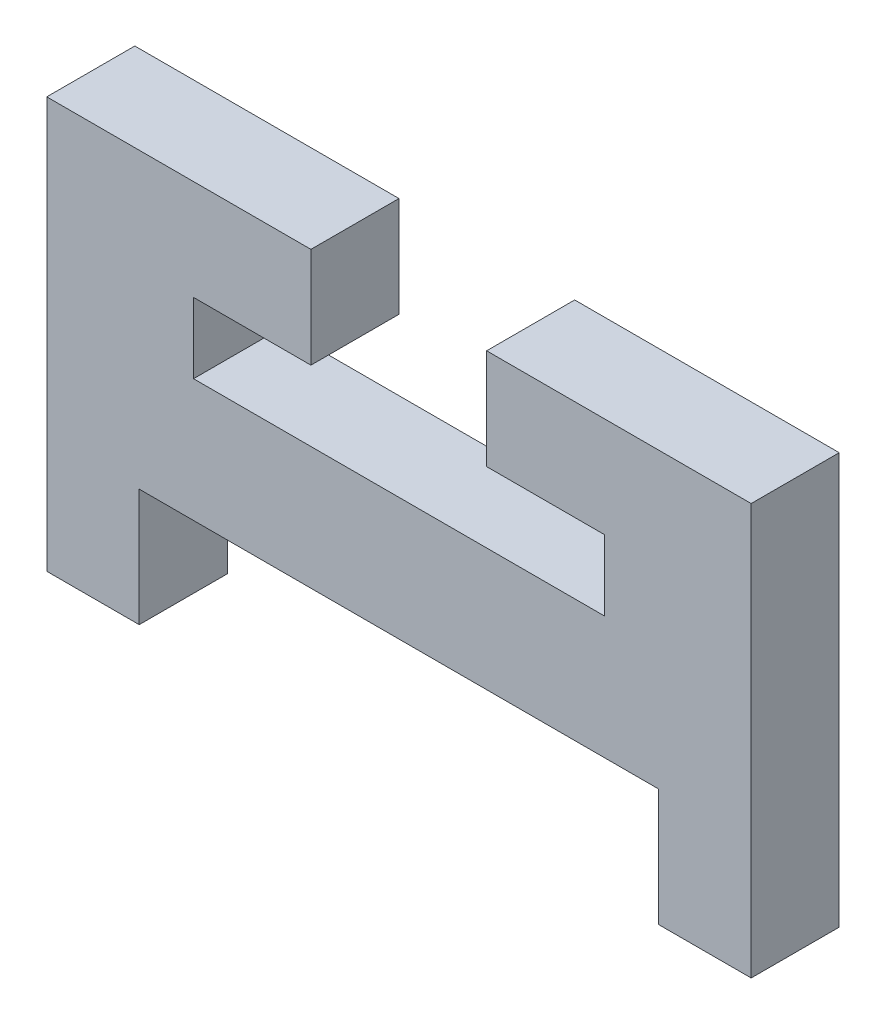
ISO-10303-21;
HEADER;
FILE_DESCRIPTION(('STEP AP214'),'2;1');
FILE_NAME('part.step','',(''),(''),'','','');
FILE_SCHEMA(('AUTOMOTIVE_DESIGN { 1 0 10303 214 1 1 1 1 }'));
ENDSEC;
DATA;
#1=APPLICATION_CONTEXT('core data for automotive mechanical design processes');
#2=APPLICATION_PROTOCOL_DEFINITION('international standard','automotive_design',2000,#1);
#3=PRODUCT_CONTEXT('',#1,'mechanical');
#4=PRODUCT('Part','Part','',(#3));
#5=PRODUCT_RELATED_PRODUCT_CATEGORY('part','',(#4));
#6=PRODUCT_DEFINITION_FORMATION('','',#4);
#7=PRODUCT_DEFINITION_CONTEXT('part definition',#1,'design');
#8=PRODUCT_DEFINITION('design','',#6,#7);
#9=PRODUCT_DEFINITION_SHAPE('','',#8);
#10=(LENGTH_UNIT() NAMED_UNIT(*) SI_UNIT(.MILLI.,.METRE.));
#11=(NAMED_UNIT(*) PLANE_ANGLE_UNIT() SI_UNIT($,.RADIAN.));
#12=(NAMED_UNIT(*) SI_UNIT($,.STERADIAN.) SOLID_ANGLE_UNIT());
#13=UNCERTAINTY_MEASURE_WITH_UNIT(LENGTH_MEASURE(1.E-05),#10,'distance_accuracy_value','');
#14=(GEOMETRIC_REPRESENTATION_CONTEXT(3) GLOBAL_UNCERTAINTY_ASSIGNED_CONTEXT((#13)) GLOBAL_UNIT_ASSIGNED_CONTEXT((#10,
#11,#12)) REPRESENTATION_CONTEXT('',''));
#15=CARTESIAN_POINT('',(0.,0.,0.));
#16=DIRECTION('',(0.,0.,1.));
#17=DIRECTION('',(1.,0.,0.));
#18=AXIS2_PLACEMENT_3D('',#15,#16,#17);
#19=CARTESIAN_POINT('',(29.5,19.6826832944775,3.));
#20=DIRECTION('',(0.,-1.,0.));
#21=DIRECTION('',(0.,0.,-1.));
#22=AXIS2_PLACEMENT_3D('',#19,#20,#21);
#23=PLANE('',#22);
#24=DIRECTION('',(-1.,0.,0.));
#25=VECTOR('',#24,1.);
#26=CARTESIAN_POINT('',(29.5,19.6826832944775,0.));
#27=LINE('',#26,#25);
#28=CARTESIAN_POINT('',(36.,19.6826832944775,0.));
#29=VERTEX_POINT('',#28);
#30=CARTESIAN_POINT('',(22.,19.6826832944775,0.));
#31=VERTEX_POINT('',#30);
#32=EDGE_CURVE('E109',#29,#31,#27,.T.);
#33=ORIENTED_EDGE('',*,*,#32,.T.);
#34=DIRECTION('',(0.,0.,-1.));
#35=VECTOR('',#34,1.);
#36=CARTESIAN_POINT('',(22.,19.6826832944775,3.));
#37=LINE('',#36,#35);
#38=CARTESIAN_POINT('',(22.,19.6826832944775,3.));
#39=VERTEX_POINT('',#38);
#40=EDGE_CURVE('E11',#39,#31,#37,.T.);
#41=ORIENTED_EDGE('',*,*,#40,.F.);
#42=DIRECTION('',(-1.,0.,0.));
#43=VECTOR('',#42,1.);
#44=CARTESIAN_POINT('',(36.,19.6826832944775,3.));
#45=LINE('',#44,#43);
#46=CARTESIAN_POINT('',(36.,19.6826832944775,3.));
#47=VERTEX_POINT('',#46);
#48=EDGE_CURVE('E115',#47,#39,#45,.T.);
#49=ORIENTED_EDGE('',*,*,#48,.F.);
#50=DIRECTION('',(0.,0.,-1.));
#51=VECTOR('',#50,1.);
#52=CARTESIAN_POINT('',(36.,19.6826832944775,3.));
#53=LINE('',#52,#51);
#54=EDGE_CURVE('E173',#47,#29,#53,.T.);
#55=ORIENTED_EDGE('',*,*,#54,.T.);
#56=EDGE_LOOP('',(#33,#41,#49,#55));
#57=FACE_BOUND('',#56,.T.);
#58=ADVANCED_FACE('F33',(#57),#23,.F.);
#59=CARTESIAN_POINT('',(22.,19.6826832944775,3.));
#60=DIRECTION('',(-1.,0.,0.));
#61=DIRECTION('',(0.,0.,1.));
#62=AXIS2_PLACEMENT_3D('',#59,#60,#61);
#63=PLANE('',#62);
#64=DIRECTION('',(0.,1.,0.));
#65=VECTOR('',#64,1.);
#66=CARTESIAN_POINT('',(22.,19.6826832944775,0.));
#67=LINE('',#66,#65);
#68=CARTESIAN_POINT('',(22.,22.0826832944775,0.));
#69=VERTEX_POINT('',#68);
#70=EDGE_CURVE('E178',#31,#69,#67,.T.);
#71=ORIENTED_EDGE('',*,*,#70,.T.);
#72=DIRECTION('',(0.,0.,-1.));
#73=VECTOR('',#72,1.);
#74=CARTESIAN_POINT('',(22.,22.0826832944775,3.));
#75=LINE('',#74,#73);
#76=CARTESIAN_POINT('',(22.,22.0826832944775,3.));
#77=VERTEX_POINT('',#76);
#78=EDGE_CURVE('E41',#77,#69,#75,.T.);
#79=ORIENTED_EDGE('',*,*,#78,.F.);
#80=DIRECTION('',(0.,1.,0.));
#81=VECTOR('',#80,1.);
#82=CARTESIAN_POINT('',(22.,19.6826832944775,3.));
#83=LINE('',#82,#81);
#84=EDGE_CURVE('E294',#39,#77,#83,.T.);
#85=ORIENTED_EDGE('',*,*,#84,.F.);
#86=ORIENTED_EDGE('',*,*,#40,.T.);
#87=EDGE_LOOP('',(#71,#79,#85,#86));
#88=FACE_BOUND('',#87,.T.);
#89=ADVANCED_FACE('F297',(#88),#63,.F.);
#90=CARTESIAN_POINT('',(22.,22.0826832944775,3.));
#91=DIRECTION('',(0.,1.,0.));
#92=DIRECTION('',(0.,0.,1.));
#93=AXIS2_PLACEMENT_3D('',#90,#91,#92);
#94=PLANE('',#93);
#95=DIRECTION('',(1.,0.,0.));
#96=VECTOR('',#95,1.);
#97=CARTESIAN_POINT('',(22.,22.0826832944775,0.));
#98=LINE('',#97,#96);
#99=CARTESIAN_POINT('',(26.,22.0826832944775,0.));
#100=VERTEX_POINT('',#99);
#101=EDGE_CURVE('E180',#69,#100,#98,.T.);
#102=ORIENTED_EDGE('',*,*,#101,.T.);
#103=DIRECTION('',(0.,0.,-1.));
#104=VECTOR('',#103,1.);
#105=CARTESIAN_POINT('',(26.,22.0826832944775,3.));
#106=LINE('',#105,#104);
#107=CARTESIAN_POINT('',(26.,22.0826832944775,3.));
#108=VERTEX_POINT('',#107);
#109=EDGE_CURVE('E237',#108,#100,#106,.T.);
#110=ORIENTED_EDGE('',*,*,#109,.F.);
#111=DIRECTION('',(1.,0.,0.));
#112=VECTOR('',#111,1.);
#113=CARTESIAN_POINT('',(22.,22.0826832944775,3.));
#114=LINE('',#113,#112);
#115=EDGE_CURVE('E246',#77,#108,#114,.T.);
#116=ORIENTED_EDGE('',*,*,#115,.F.);
#117=ORIENTED_EDGE('',*,*,#78,.T.);
#118=EDGE_LOOP('',(#102,#110,#116,#117));
#119=FACE_BOUND('',#118,.T.);
#120=ADVANCED_FACE('F244',(#119),#94,.F.);
#121=CARTESIAN_POINT('',(26.,22.0826832944775,3.));
#122=DIRECTION('',(-1.,0.,0.));
#123=DIRECTION('',(0.,0.,1.));
#124=AXIS2_PLACEMENT_3D('',#121,#122,#123);
#125=PLANE('',#124);
#126=DIRECTION('',(0.,1.,0.));
#127=VECTOR('',#126,1.);
#128=CARTESIAN_POINT('',(26.,22.0826832944775,0.));
#129=LINE('',#128,#127);
#130=CARTESIAN_POINT('',(26.,25.5,0.));
#131=VERTEX_POINT('',#130);
#132=EDGE_CURVE('E182',#100,#131,#129,.T.);
#133=ORIENTED_EDGE('',*,*,#132,.T.);
#134=DIRECTION('',(0.,0.,-1.));
#135=VECTOR('',#134,1.);
#136=CARTESIAN_POINT('',(26.,25.5,3.));
#137=LINE('',#136,#135);
#138=CARTESIAN_POINT('',(26.,25.5,3.));
#139=VERTEX_POINT('',#138);
#140=EDGE_CURVE('E234',#139,#131,#137,.T.);
#141=ORIENTED_EDGE('',*,*,#140,.F.);
#142=DIRECTION('',(0.,1.,0.));
#143=VECTOR('',#142,1.);
#144=CARTESIAN_POINT('',(26.,22.0826832944775,3.));
#145=LINE('',#144,#143);
#146=EDGE_CURVE('E264',#108,#139,#145,.T.);
#147=ORIENTED_EDGE('',*,*,#146,.F.);
#148=ORIENTED_EDGE('',*,*,#109,.T.);
#149=EDGE_LOOP('',(#133,#141,#147,#148));
#150=FACE_BOUND('',#149,.T.);
#151=ADVANCED_FACE('F255',(#150),#125,.F.);
#152=CARTESIAN_POINT('',(26.,25.5,3.));
#153=DIRECTION('',(0.,-1.,0.));
#154=DIRECTION('',(0.,0.,-1.));
#155=AXIS2_PLACEMENT_3D('',#152,#153,#154);
#156=PLANE('',#155);
#157=DIRECTION('',(-1.,0.,0.));
#158=VECTOR('',#157,1.);
#159=CARTESIAN_POINT('',(26.,25.5,0.));
#160=LINE('',#159,#158);
#161=CARTESIAN_POINT('',(17.,25.5,0.));
#162=VERTEX_POINT('',#161);
#163=EDGE_CURVE('E184',#131,#162,#160,.T.);
#164=ORIENTED_EDGE('',*,*,#163,.T.);
#165=DIRECTION('',(0.,0.,-1.));
#166=VECTOR('',#165,1.);
#167=CARTESIAN_POINT('',(17.,25.5,3.));
#168=LINE('',#167,#166);
#169=CARTESIAN_POINT('',(17.,25.5,3.));
#170=VERTEX_POINT('',#169);
#171=EDGE_CURVE('E231',#170,#162,#168,.T.);
#172=ORIENTED_EDGE('',*,*,#171,.F.);
#173=DIRECTION('',(-1.,0.,0.));
#174=VECTOR('',#173,1.);
#175=CARTESIAN_POINT('',(26.,25.5,3.));
#176=LINE('',#175,#174);
#177=EDGE_CURVE('E261',#139,#170,#176,.T.);
#178=ORIENTED_EDGE('',*,*,#177,.F.);
#179=ORIENTED_EDGE('',*,*,#140,.T.);
#180=EDGE_LOOP('',(#164,#172,#178,#179));
#181=FACE_BOUND('',#180,.T.);
#182=ADVANCED_FACE('F259',(#181),#156,.F.);
#183=CARTESIAN_POINT('',(17.,25.5,3.));
#184=DIRECTION('',(1.,0.,0.));
#185=DIRECTION('',(0.,0.,-1.));
#186=AXIS2_PLACEMENT_3D('',#183,#184,#185);
#187=PLANE('',#186);
#188=DIRECTION('',(0.,-1.,0.));
#189=VECTOR('',#188,1.);
#190=CARTESIAN_POINT('',(17.,25.5,0.));
#191=LINE('',#190,#189);
#192=CARTESIAN_POINT('',(17.,11.5,0.));
#193=VERTEX_POINT('',#192);
#194=EDGE_CURVE('E186',#162,#193,#191,.T.);
#195=ORIENTED_EDGE('',*,*,#194,.T.);
#196=DIRECTION('',(0.,0.,-1.));
#197=VECTOR('',#196,1.);
#198=CARTESIAN_POINT('',(17.,11.5,3.));
#199=LINE('',#198,#197);
#200=CARTESIAN_POINT('',(17.,11.5,3.));
#201=VERTEX_POINT('',#200);
#202=EDGE_CURVE('E228',#201,#193,#199,.T.);
#203=ORIENTED_EDGE('',*,*,#202,.F.);
#204=DIRECTION('',(0.,-1.,0.));
#205=VECTOR('',#204,1.);
#206=CARTESIAN_POINT('',(17.,25.5,3.));
#207=LINE('',#206,#205);
#208=EDGE_CURVE('E263',#170,#201,#207,.T.);
#209=ORIENTED_EDGE('',*,*,#208,.F.);
#210=ORIENTED_EDGE('',*,*,#171,.T.);
#211=EDGE_LOOP('',(#195,#203,#209,#210));
#212=FACE_BOUND('',#211,.T.);
#213=ADVANCED_FACE('F309',(#212),#187,.F.);
#214=CARTESIAN_POINT('',(17.,11.5,3.));
#215=DIRECTION('',(0.,1.,0.));
#216=DIRECTION('',(0.,0.,1.));
#217=AXIS2_PLACEMENT_3D('',#214,#215,#216);
#218=PLANE('',#217);
#219=DIRECTION('',(1.,0.,0.));
#220=VECTOR('',#219,1.);
#221=CARTESIAN_POINT('',(17.,11.5,0.));
#222=LINE('',#221,#220);
#223=CARTESIAN_POINT('',(20.15,11.5,0.));
#224=VERTEX_POINT('',#223);
#225=EDGE_CURVE('E188',#193,#224,#222,.T.);
#226=ORIENTED_EDGE('',*,*,#225,.T.);
#227=DIRECTION('',(0.,0.,-1.));
#228=VECTOR('',#227,1.);
#229=CARTESIAN_POINT('',(20.15,11.5,3.));
#230=LINE('',#229,#228);
#231=CARTESIAN_POINT('',(20.15,11.5,3.));
#232=VERTEX_POINT('',#231);
#233=EDGE_CURVE('E225',#232,#224,#230,.T.);
#234=ORIENTED_EDGE('',*,*,#233,.F.);
#235=DIRECTION('',(1.,0.,0.));
#236=VECTOR('',#235,1.);
#237=CARTESIAN_POINT('',(17.,11.5,3.));
#238=LINE('',#237,#236);
#239=EDGE_CURVE('E266',#201,#232,#238,.T.);
#240=ORIENTED_EDGE('',*,*,#239,.F.);
#241=ORIENTED_EDGE('',*,*,#202,.T.);
#242=EDGE_LOOP('',(#226,#234,#240,#241));
#243=FACE_BOUND('',#242,.T.);
#244=ADVANCED_FACE('F312',(#243),#218,.F.);
#245=CARTESIAN_POINT('',(20.15,11.5,3.));
#246=DIRECTION('',(-1.,0.,0.));
#247=DIRECTION('',(0.,0.,1.));
#248=AXIS2_PLACEMENT_3D('',#245,#246,#247);
#249=PLANE('',#248);
#250=DIRECTION('',(0.,1.,0.));
#251=VECTOR('',#250,1.);
#252=CARTESIAN_POINT('',(20.15,11.5,0.));
#253=LINE('',#252,#251);
#254=CARTESIAN_POINT('',(20.15,15.5,0.));
#255=VERTEX_POINT('',#254);
#256=EDGE_CURVE('E190',#224,#255,#253,.T.);
#257=ORIENTED_EDGE('',*,*,#256,.T.);
#258=DIRECTION('',(0.,0.,-1.));
#259=VECTOR('',#258,1.);
#260=CARTESIAN_POINT('',(20.15,15.5,3.));
#261=LINE('',#260,#259);
#262=CARTESIAN_POINT('',(20.15,15.5,3.));
#263=VERTEX_POINT('',#262);
#264=EDGE_CURVE('E222',#263,#255,#261,.T.);
#265=ORIENTED_EDGE('',*,*,#264,.F.);
#266=DIRECTION('',(0.,1.,0.));
#267=VECTOR('',#266,1.);
#268=CARTESIAN_POINT('',(20.15,11.5,3.));
#269=LINE('',#268,#267);
#270=EDGE_CURVE('E272',#232,#263,#269,.T.);
#271=ORIENTED_EDGE('',*,*,#270,.F.);
#272=ORIENTED_EDGE('',*,*,#233,.T.);
#273=EDGE_LOOP('',(#257,#265,#271,#272));
#274=FACE_BOUND('',#273,.T.);
#275=ADVANCED_FACE('F316',(#274),#249,.F.);
#276=CARTESIAN_POINT('',(20.15,15.5,3.));
#277=DIRECTION('',(0.,1.,0.));
#278=DIRECTION('',(0.,0.,1.));
#279=AXIS2_PLACEMENT_3D('',#276,#277,#278);
#280=PLANE('',#279);
#281=DIRECTION('',(1.,0.,0.));
#282=VECTOR('',#281,1.);
#283=CARTESIAN_POINT('',(20.15,15.5,0.));
#284=LINE('',#283,#282);
#285=CARTESIAN_POINT('',(37.85,15.5,0.));
#286=VERTEX_POINT('',#285);
#287=EDGE_CURVE('E192',#255,#286,#284,.T.);
#288=ORIENTED_EDGE('',*,*,#287,.T.);
#289=DIRECTION('',(0.,0.,-1.));
#290=VECTOR('',#289,1.);
#291=CARTESIAN_POINT('',(37.85,15.5,3.));
#292=LINE('',#291,#290);
#293=CARTESIAN_POINT('',(37.85,15.5,3.));
#294=VERTEX_POINT('',#293);
#295=EDGE_CURVE('E219',#294,#286,#292,.T.);
#296=ORIENTED_EDGE('',*,*,#295,.F.);
#297=DIRECTION('',(1.,0.,0.));
#298=VECTOR('',#297,1.);
#299=CARTESIAN_POINT('',(20.15,15.5,3.));
#300=LINE('',#299,#298);
#301=EDGE_CURVE('E274',#263,#294,#300,.T.);
#302=ORIENTED_EDGE('',*,*,#301,.F.);
#303=ORIENTED_EDGE('',*,*,#264,.T.);
#304=EDGE_LOOP('',(#288,#296,#302,#303));
#305=FACE_BOUND('',#304,.T.);
#306=ADVANCED_FACE('F320',(#305),#280,.F.);
#307=CARTESIAN_POINT('',(37.85,15.5,3.));
#308=DIRECTION('',(1.,0.,0.));
#309=DIRECTION('',(0.,0.,-1.));
#310=AXIS2_PLACEMENT_3D('',#307,#308,#309);
#311=PLANE('',#310);
#312=DIRECTION('',(0.,-1.,0.));
#313=VECTOR('',#312,1.);
#314=CARTESIAN_POINT('',(37.85,15.5,0.));
#315=LINE('',#314,#313);
#316=CARTESIAN_POINT('',(37.85,11.5,0.));
#317=VERTEX_POINT('',#316);
#318=EDGE_CURVE('E194',#286,#317,#315,.T.);
#319=ORIENTED_EDGE('',*,*,#318,.T.);
#320=DIRECTION('',(0.,0.,-1.));
#321=VECTOR('',#320,1.);
#322=CARTESIAN_POINT('',(37.85,11.5,3.));
#323=LINE('',#322,#321);
#324=CARTESIAN_POINT('',(37.85,11.5,3.));
#325=VERTEX_POINT('',#324);
#326=EDGE_CURVE('E216',#325,#317,#323,.T.);
#327=ORIENTED_EDGE('',*,*,#326,.F.);
#328=DIRECTION('',(0.,-1.,0.));
#329=VECTOR('',#328,1.);
#330=CARTESIAN_POINT('',(37.85,15.5,3.));
#331=LINE('',#330,#329);
#332=EDGE_CURVE('E276',#294,#325,#331,.T.);
#333=ORIENTED_EDGE('',*,*,#332,.F.);
#334=ORIENTED_EDGE('',*,*,#295,.T.);
#335=EDGE_LOOP('',(#319,#327,#333,#334));
#336=FACE_BOUND('',#335,.T.);
#337=ADVANCED_FACE('F324',(#336),#311,.F.);
#338=CARTESIAN_POINT('',(37.85,11.5,3.));
#339=DIRECTION('',(0.,1.,0.));
#340=DIRECTION('',(0.,0.,1.));
#341=AXIS2_PLACEMENT_3D('',#338,#339,#340);
#342=PLANE('',#341);
#343=DIRECTION('',(1.,0.,0.));
#344=VECTOR('',#343,1.);
#345=CARTESIAN_POINT('',(37.85,11.5,0.));
#346=LINE('',#345,#344);
#347=CARTESIAN_POINT('',(41.,11.5,0.));
#348=VERTEX_POINT('',#347);
#349=EDGE_CURVE('E196',#317,#348,#346,.T.);
#350=ORIENTED_EDGE('',*,*,#349,.T.);
#351=DIRECTION('',(0.,0.,-1.));
#352=VECTOR('',#351,1.);
#353=CARTESIAN_POINT('',(41.,11.5,3.));
#354=LINE('',#353,#352);
#355=CARTESIAN_POINT('',(41.,11.5,3.));
#356=VERTEX_POINT('',#355);
#357=EDGE_CURVE('E213',#356,#348,#354,.T.);
#358=ORIENTED_EDGE('',*,*,#357,.F.);
#359=DIRECTION('',(1.,0.,0.));
#360=VECTOR('',#359,1.);
#361=CARTESIAN_POINT('',(37.85,11.5,3.));
#362=LINE('',#361,#360);
#363=EDGE_CURVE('E278',#325,#356,#362,.T.);
#364=ORIENTED_EDGE('',*,*,#363,.F.);
#365=ORIENTED_EDGE('',*,*,#326,.T.);
#366=EDGE_LOOP('',(#350,#358,#364,#365));
#367=FACE_BOUND('',#366,.T.);
#368=ADVANCED_FACE('F328',(#367),#342,.F.);
#369=CARTESIAN_POINT('',(41.,11.5,3.));
#370=DIRECTION('',(-1.,0.,0.));
#371=DIRECTION('',(0.,0.,1.));
#372=AXIS2_PLACEMENT_3D('',#369,#370,#371);
#373=PLANE('',#372);
#374=DIRECTION('',(0.,1.,0.));
#375=VECTOR('',#374,1.);
#376=CARTESIAN_POINT('',(41.,11.5,0.));
#377=LINE('',#376,#375);
#378=CARTESIAN_POINT('',(41.,25.5,0.));
#379=VERTEX_POINT('',#378);
#380=EDGE_CURVE('E198',#348,#379,#377,.T.);
#381=ORIENTED_EDGE('',*,*,#380,.T.);
#382=DIRECTION('',(0.,0.,-1.));
#383=VECTOR('',#382,1.);
#384=CARTESIAN_POINT('',(41.,25.5,3.));
#385=LINE('',#384,#383);
#386=CARTESIAN_POINT('',(41.,25.5,3.));
#387=VERTEX_POINT('',#386);
#388=EDGE_CURVE('E210',#387,#379,#385,.T.);
#389=ORIENTED_EDGE('',*,*,#388,.F.);
#390=DIRECTION('',(0.,1.,0.));
#391=VECTOR('',#390,1.);
#392=CARTESIAN_POINT('',(41.,11.5,3.));
#393=LINE('',#392,#391);
#394=EDGE_CURVE('E280',#356,#387,#393,.T.);
#395=ORIENTED_EDGE('',*,*,#394,.F.);
#396=ORIENTED_EDGE('',*,*,#357,.T.);
#397=EDGE_LOOP('',(#381,#389,#395,#396));
#398=FACE_BOUND('',#397,.T.);
#399=ADVANCED_FACE('F286',(#398),#373,.F.);
#400=CARTESIAN_POINT('',(41.,25.5,3.));
#401=DIRECTION('',(0.,-1.,0.));
#402=DIRECTION('',(0.,0.,-1.));
#403=AXIS2_PLACEMENT_3D('',#400,#401,#402);
#404=PLANE('',#403);
#405=DIRECTION('',(-1.,0.,0.));
#406=VECTOR('',#405,1.);
#407=CARTESIAN_POINT('',(41.,25.5,0.));
#408=LINE('',#407,#406);
#409=CARTESIAN_POINT('',(31.9863854020223,25.5,0.));
#410=VERTEX_POINT('',#409);
#411=EDGE_CURVE('E200',#379,#410,#408,.T.);
#412=ORIENTED_EDGE('',*,*,#411,.T.);
#413=DIRECTION('',(0.,0.,-1.));
#414=VECTOR('',#413,1.);
#415=CARTESIAN_POINT('',(31.9863854020223,25.5,3.));
#416=LINE('',#415,#414);
#417=CARTESIAN_POINT('',(31.9863854020223,25.5,3.));
#418=VERTEX_POINT('',#417);
#419=EDGE_CURVE('E168',#418,#410,#416,.T.);
#420=ORIENTED_EDGE('',*,*,#419,.F.);
#421=DIRECTION('',(-1.,0.,0.));
#422=VECTOR('',#421,1.);
#423=CARTESIAN_POINT('',(41.,25.5,3.));
#424=LINE('',#423,#422);
#425=EDGE_CURVE('E159',#387,#418,#424,.T.);
#426=ORIENTED_EDGE('',*,*,#425,.F.);
#427=ORIENTED_EDGE('',*,*,#388,.T.);
#428=EDGE_LOOP('',(#412,#420,#426,#427));
#429=FACE_BOUND('',#428,.T.);
#430=ADVANCED_FACE('F290',(#429),#404,.F.);
#431=CARTESIAN_POINT('',(31.9863854020223,25.5,3.));
#432=DIRECTION('',(1.,0.,0.));
#433=DIRECTION('',(0.,0.,-1.));
#434=AXIS2_PLACEMENT_3D('',#431,#432,#433);
#435=PLANE('',#434);
#436=DIRECTION('',(0.,-1.,0.));
#437=VECTOR('',#436,1.);
#438=CARTESIAN_POINT('',(31.9863854020223,25.5,0.));
#439=LINE('',#438,#437);
#440=CARTESIAN_POINT('',(31.9863854020223,22.0826832944775,0.));
#441=VERTEX_POINT('',#440);
#442=EDGE_CURVE('E167',#410,#441,#439,.T.);
#443=ORIENTED_EDGE('',*,*,#442,.T.);
#444=DIRECTION('',(0.,0.,-1.));
#445=VECTOR('',#444,1.);
#446=CARTESIAN_POINT('',(31.9863854020223,22.0826832944775,3.));
#447=LINE('',#446,#445);
#448=CARTESIAN_POINT('',(31.9863854020223,22.0826832944775,3.));
#449=VERTEX_POINT('',#448);
#450=EDGE_CURVE('E164',#449,#441,#447,.T.);
#451=ORIENTED_EDGE('',*,*,#450,.F.);
#452=DIRECTION('',(0.,-1.,0.));
#453=VECTOR('',#452,1.);
#454=CARTESIAN_POINT('',(31.9863854020223,25.5,3.));
#455=LINE('',#454,#453);
#456=EDGE_CURVE('E153',#418,#449,#455,.T.);
#457=ORIENTED_EDGE('',*,*,#456,.F.);
#458=ORIENTED_EDGE('',*,*,#419,.T.);
#459=EDGE_LOOP('',(#443,#451,#457,#458));
#460=FACE_BOUND('',#459,.T.);
#461=ADVANCED_FACE('F165',(#460),#435,.F.);
#462=CARTESIAN_POINT('',(31.9863854020223,22.0826832944775,3.));
#463=DIRECTION('',(0.,1.,0.));
#464=DIRECTION('',(0.,0.,1.));
#465=AXIS2_PLACEMENT_3D('',#462,#463,#464);
#466=PLANE('',#465);
#467=DIRECTION('',(1.,0.,0.));
#468=VECTOR('',#467,1.);
#469=CARTESIAN_POINT('',(31.9863854020223,22.0826832944775,0.));
#470=LINE('',#469,#468);
#471=CARTESIAN_POINT('',(36.,22.0826832944775,0.));
#472=VERTEX_POINT('',#471);
#473=EDGE_CURVE('E102',#441,#472,#470,.T.);
#474=ORIENTED_EDGE('',*,*,#473,.T.);
#475=DIRECTION('',(0.,0.,-1.));
#476=VECTOR('',#475,1.);
#477=CARTESIAN_POINT('',(36.,22.0826832944775,3.));
#478=LINE('',#477,#476);
#479=CARTESIAN_POINT('',(36.,22.0826832944775,3.));
#480=VERTEX_POINT('',#479);
#481=EDGE_CURVE('E169',#480,#472,#478,.T.);
#482=ORIENTED_EDGE('',*,*,#481,.F.);
#483=DIRECTION('',(1.,0.,0.));
#484=VECTOR('',#483,1.);
#485=CARTESIAN_POINT('',(31.9863854020223,22.0826832944775,3.));
#486=LINE('',#485,#484);
#487=EDGE_CURVE('E157',#449,#480,#486,.T.);
#488=ORIENTED_EDGE('',*,*,#487,.F.);
#489=ORIENTED_EDGE('',*,*,#450,.T.);
#490=EDGE_LOOP('',(#474,#482,#488,#489));
#491=FACE_BOUND('',#490,.T.);
#492=ADVANCED_FACE('F171',(#491),#466,.F.);
#493=CARTESIAN_POINT('',(36.,22.0826832944775,3.));
#494=DIRECTION('',(1.,0.,0.));
#495=DIRECTION('',(0.,0.,-1.));
#496=AXIS2_PLACEMENT_3D('',#493,#494,#495);
#497=PLANE('',#496);
#498=DIRECTION('',(0.,-1.,0.));
#499=VECTOR('',#498,1.);
#500=CARTESIAN_POINT('',(36.,22.0826832944775,0.));
#501=LINE('',#500,#499);
#502=EDGE_CURVE('E204',#472,#29,#501,.T.);
#503=ORIENTED_EDGE('',*,*,#502,.T.);
#504=ORIENTED_EDGE('',*,*,#54,.F.);
#505=DIRECTION('',(0.,-1.,0.));
#506=VECTOR('',#505,1.);
#507=CARTESIAN_POINT('',(36.,22.0826832944775,3.));
#508=LINE('',#507,#506);
#509=EDGE_CURVE('E49',#480,#47,#508,.T.);
#510=ORIENTED_EDGE('',*,*,#509,.F.);
#511=ORIENTED_EDGE('',*,*,#481,.T.);
#512=EDGE_LOOP('',(#503,#504,#510,#511));
#513=FACE_BOUND('',#512,.T.);
#514=ADVANCED_FACE('F292',(#513),#497,.F.);
#515=CARTESIAN_POINT('',(0.,0.,3.));
#516=DIRECTION('',(0.,0.,-1.));
#517=DIRECTION('',(-1.,0.,0.));
#518=AXIS2_PLACEMENT_3D('',#515,#516,#517);
#519=PLANE('',#518);
#520=ORIENTED_EDGE('',*,*,#48,.T.);
#521=ORIENTED_EDGE('',*,*,#84,.T.);
#522=ORIENTED_EDGE('',*,*,#115,.T.);
#523=ORIENTED_EDGE('',*,*,#146,.T.);
#524=ORIENTED_EDGE('',*,*,#177,.T.);
#525=ORIENTED_EDGE('',*,*,#208,.T.);
#526=ORIENTED_EDGE('',*,*,#239,.T.);
#527=ORIENTED_EDGE('',*,*,#270,.T.);
#528=ORIENTED_EDGE('',*,*,#301,.T.);
#529=ORIENTED_EDGE('',*,*,#332,.T.);
#530=ORIENTED_EDGE('',*,*,#363,.T.);
#531=ORIENTED_EDGE('',*,*,#394,.T.);
#532=ORIENTED_EDGE('',*,*,#425,.T.);
#533=ORIENTED_EDGE('',*,*,#456,.T.);
#534=ORIENTED_EDGE('',*,*,#487,.T.);
#535=ORIENTED_EDGE('',*,*,#509,.T.);
#536=EDGE_LOOP('',(#520,#521,#522,#523,#524,#525,#526,#527,#528,#529,#530,#531,#532,#533,#534,#535));
#537=FACE_BOUND('',#536,.T.);
#538=ADVANCED_FACE('F155',(#537),#519,.F.);
#539=CARTESIAN_POINT('',(0.,0.,0.));
#540=DIRECTION('',(0.,0.,-1.));
#541=DIRECTION('',(-1.,0.,0.));
#542=AXIS2_PLACEMENT_3D('',#539,#540,#541);
#543=PLANE('',#542);
#544=ORIENTED_EDGE('',*,*,#32,.F.);
#545=ORIENTED_EDGE('',*,*,#502,.F.);
#546=ORIENTED_EDGE('',*,*,#473,.F.);
#547=ORIENTED_EDGE('',*,*,#442,.F.);
#548=ORIENTED_EDGE('',*,*,#411,.F.);
#549=ORIENTED_EDGE('',*,*,#380,.F.);
#550=ORIENTED_EDGE('',*,*,#349,.F.);
#551=ORIENTED_EDGE('',*,*,#318,.F.);
#552=ORIENTED_EDGE('',*,*,#287,.F.);
#553=ORIENTED_EDGE('',*,*,#256,.F.);
#554=ORIENTED_EDGE('',*,*,#225,.F.);
#555=ORIENTED_EDGE('',*,*,#194,.F.);
#556=ORIENTED_EDGE('',*,*,#163,.F.);
#557=ORIENTED_EDGE('',*,*,#132,.F.);
#558=ORIENTED_EDGE('',*,*,#101,.F.);
#559=ORIENTED_EDGE('',*,*,#70,.F.);
#560=EDGE_LOOP('',(#544,#545,#546,#547,#548,#549,#550,#551,#552,#553,#554,#555,#556,#557,#558,#559));
#561=FACE_BOUND('',#560,.T.);
#562=ADVANCED_FACE('F250',(#561),#543,.T.);
#563=CLOSED_SHELL('',(#58,#89,#120,#151,#182,#213,#244,#275,#306,#337,#368,#399,#430,#461,#492,
#514,#538,#562));
#564=MANIFOLD_SOLID_BREP('B2',#563);
#565=ADVANCED_BREP_SHAPE_REPRESENTATION('',(#18,#564),#14);
#566=SHAPE_DEFINITION_REPRESENTATION(#9,#565);
ENDSEC;
END-ISO-10303-21;
